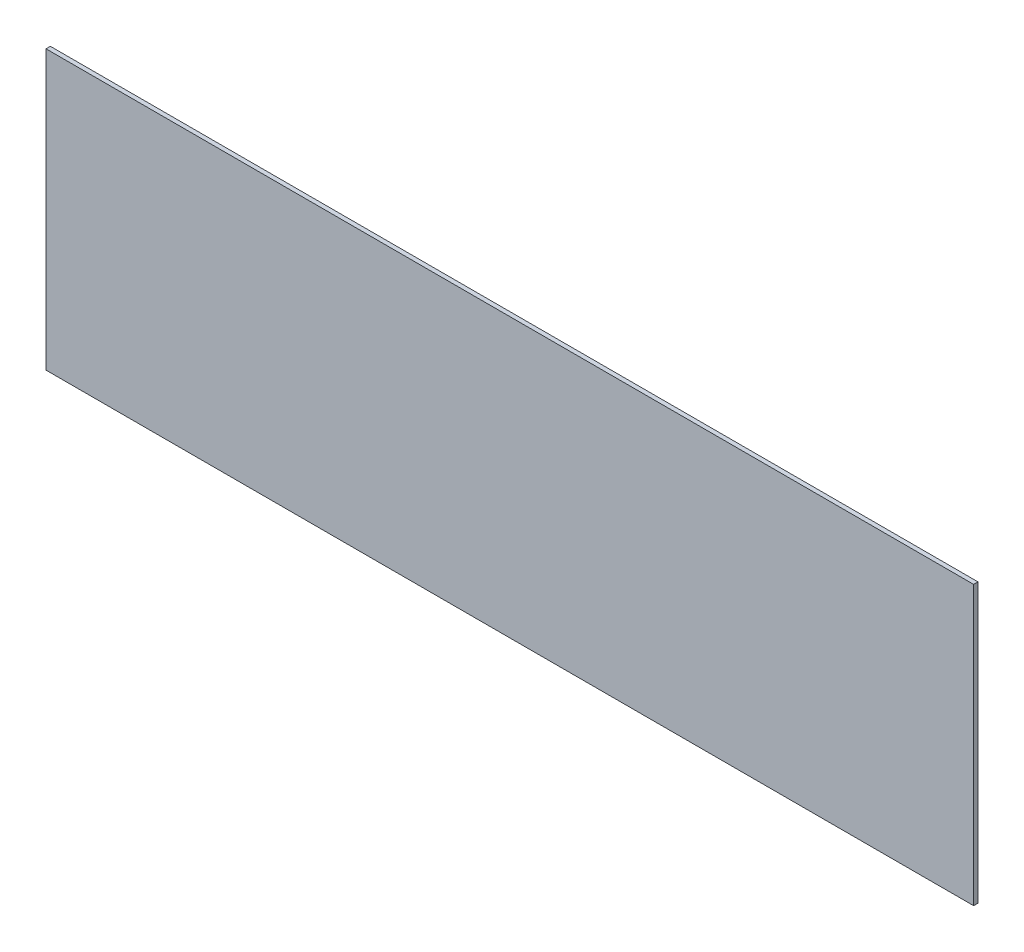
ISO-10303-21;
HEADER;
FILE_DESCRIPTION(('STEP AP214'),'2;1');
FILE_NAME('part.step','',(''),(''),'','','');
FILE_SCHEMA(('AUTOMOTIVE_DESIGN { 1 0 10303 214 1 1 1 1 }'));
ENDSEC;
DATA;
#1=APPLICATION_CONTEXT('core data for automotive mechanical design processes');
#2=APPLICATION_PROTOCOL_DEFINITION('international standard','automotive_design',2000,#1);
#3=PRODUCT_CONTEXT('',#1,'mechanical');
#4=PRODUCT('Part','Part','',(#3));
#5=PRODUCT_RELATED_PRODUCT_CATEGORY('part','',(#4));
#6=PRODUCT_DEFINITION_FORMATION('','',#4);
#7=PRODUCT_DEFINITION_CONTEXT('part definition',#1,'design');
#8=PRODUCT_DEFINITION('design','',#6,#7);
#9=PRODUCT_DEFINITION_SHAPE('','',#8);
#10=(LENGTH_UNIT() NAMED_UNIT(*) SI_UNIT(.MILLI.,.METRE.));
#11=(NAMED_UNIT(*) PLANE_ANGLE_UNIT() SI_UNIT($,.RADIAN.));
#12=(NAMED_UNIT(*) SI_UNIT($,.STERADIAN.) SOLID_ANGLE_UNIT());
#13=UNCERTAINTY_MEASURE_WITH_UNIT(LENGTH_MEASURE(1.E-05),#10,'distance_accuracy_value','');
#14=(GEOMETRIC_REPRESENTATION_CONTEXT(3) GLOBAL_UNCERTAINTY_ASSIGNED_CONTEXT((#13)) GLOBAL_UNIT_ASSIGNED_CONTEXT((#10,
#11,#12)) REPRESENTATION_CONTEXT('',''));
#15=CARTESIAN_POINT('',(0.,0.,0.));
#16=DIRECTION('',(0.,0.,1.));
#17=DIRECTION('',(1.,0.,0.));
#18=AXIS2_PLACEMENT_3D('',#15,#16,#17);
#19=CARTESIAN_POINT('',(481.0125,-130.175,4.7625));
#20=DIRECTION('',(0.,0.,1.));
#21=DIRECTION('',(1.,0.,0.));
#22=AXIS2_PLACEMENT_3D('',#19,#20,#21);
#23=PLANE('',#22);
#24=DIRECTION('',(0.,1.,0.));
#25=VECTOR('',#24,1.);
#26=CARTESIAN_POINT('',(989.0125,22.225,4.7625));
#27=LINE('',#26,#25);
#28=CARTESIAN_POINT('',(989.0125,22.225,4.7625));
#29=VERTEX_POINT('',#28);
#30=CARTESIAN_POINT('',(989.0125,-282.575,4.7625));
#31=VERTEX_POINT('',#30);
#32=EDGE_CURVE('E68',#29,#31,#27,.F.);
#33=ORIENTED_EDGE('',*,*,#32,.F.);
#34=DIRECTION('',(1.,0.,0.));
#35=VECTOR('',#34,1.);
#36=CARTESIAN_POINT('',(-26.9875,22.225,4.7625));
#37=LINE('',#36,#35);
#38=CARTESIAN_POINT('',(-26.9875,22.225,4.7625));
#39=VERTEX_POINT('',#38);
#40=EDGE_CURVE('E20',#39,#29,#37,.T.);
#41=ORIENTED_EDGE('',*,*,#40,.F.);
#42=DIRECTION('',(0.,1.,0.));
#43=VECTOR('',#42,1.);
#44=CARTESIAN_POINT('',(-26.9875,-282.575,4.7625));
#45=LINE('',#44,#43);
#46=CARTESIAN_POINT('',(-26.9875,-282.575,4.7625));
#47=VERTEX_POINT('',#46);
#48=EDGE_CURVE('E58',#47,#39,#45,.T.);
#49=ORIENTED_EDGE('',*,*,#48,.F.);
#50=DIRECTION('',(1.,0.,0.));
#51=VECTOR('',#50,1.);
#52=CARTESIAN_POINT('',(989.0125,-282.575,4.7625));
#53=LINE('',#52,#51);
#54=EDGE_CURVE('E53',#31,#47,#53,.F.);
#55=ORIENTED_EDGE('',*,*,#54,.F.);
#56=EDGE_LOOP('',(#33,#41,#49,#55));
#57=FACE_BOUND('',#56,.T.);
#58=ADVANCED_FACE('F17',(#57),#23,.T.);
#59=CARTESIAN_POINT('',(-26.9875,22.225,0.));
#60=DIRECTION('',(0.,1.,0.));
#61=DIRECTION('',(0.,0.,1.));
#62=AXIS2_PLACEMENT_3D('',#59,#60,#61);
#63=PLANE('',#62);
#64=ORIENTED_EDGE('',*,*,#40,.T.);
#65=DIRECTION('',(0.,0.,-1.));
#66=VECTOR('',#65,1.);
#67=CARTESIAN_POINT('',(989.0125,22.225,0.));
#68=LINE('',#67,#66);
#69=CARTESIAN_POINT('',(989.0125,22.225,0.));
#70=VERTEX_POINT('',#69);
#71=EDGE_CURVE('E79',#70,#29,#68,.F.);
#72=ORIENTED_EDGE('',*,*,#71,.F.);
#73=DIRECTION('',(1.,0.,0.));
#74=VECTOR('',#73,1.);
#75=CARTESIAN_POINT('',(481.0125,22.225,0.));
#76=LINE('',#75,#74);
#77=CARTESIAN_POINT('',(-26.9875,22.225,0.));
#78=VERTEX_POINT('',#77);
#79=EDGE_CURVE('E74',#70,#78,#76,.F.);
#80=ORIENTED_EDGE('',*,*,#79,.T.);
#81=DIRECTION('',(0.,0.,1.));
#82=VECTOR('',#81,1.);
#83=CARTESIAN_POINT('',(-26.9875,22.225,0.));
#84=LINE('',#83,#82);
#85=EDGE_CURVE('E63',#39,#78,#84,.F.);
#86=ORIENTED_EDGE('',*,*,#85,.F.);
#87=EDGE_LOOP('',(#64,#72,#80,#86));
#88=FACE_BOUND('',#87,.T.);
#89=ADVANCED_FACE('F73',(#88),#63,.T.);
#90=CARTESIAN_POINT('',(-26.9875,-282.575,0.));
#91=DIRECTION('',(-1.,0.,0.));
#92=DIRECTION('',(0.,0.,1.));
#93=AXIS2_PLACEMENT_3D('',#90,#91,#92);
#94=PLANE('',#93);
#95=ORIENTED_EDGE('',*,*,#48,.T.);
#96=ORIENTED_EDGE('',*,*,#85,.T.);
#97=DIRECTION('',(0.,1.,0.));
#98=VECTOR('',#97,1.);
#99=CARTESIAN_POINT('',(-26.9875,-130.175,0.));
#100=LINE('',#99,#98);
#101=CARTESIAN_POINT('',(-26.9875,-282.575,0.));
#102=VERTEX_POINT('',#101);
#103=EDGE_CURVE('E84',#78,#102,#100,.F.);
#104=ORIENTED_EDGE('',*,*,#103,.T.);
#105=DIRECTION('',(0.,0.,-1.));
#106=VECTOR('',#105,1.);
#107=CARTESIAN_POINT('',(-26.9874999999999,-282.575,0.));
#108=LINE('',#107,#106);
#109=EDGE_CURVE('E65',#47,#102,#108,.T.);
#110=ORIENTED_EDGE('',*,*,#109,.F.);
#111=EDGE_LOOP('',(#95,#96,#104,#110));
#112=FACE_BOUND('',#111,.T.);
#113=ADVANCED_FACE('F60',(#112),#94,.T.);
#114=CARTESIAN_POINT('',(989.0125,-282.575,0.));
#115=DIRECTION('',(0.,-1.,0.));
#116=DIRECTION('',(0.,0.,-1.));
#117=AXIS2_PLACEMENT_3D('',#114,#115,#116);
#118=PLANE('',#117);
#119=ORIENTED_EDGE('',*,*,#54,.T.);
#120=ORIENTED_EDGE('',*,*,#109,.T.);
#121=DIRECTION('',(1.,0.,0.));
#122=VECTOR('',#121,1.);
#123=CARTESIAN_POINT('',(481.0125,-282.575,0.));
#124=LINE('',#123,#122);
#125=CARTESIAN_POINT('',(989.0125,-282.575,0.));
#126=VERTEX_POINT('',#125);
#127=EDGE_CURVE('E26',#102,#126,#124,.T.);
#128=ORIENTED_EDGE('',*,*,#127,.T.);
#129=DIRECTION('',(0.,0.,-1.));
#130=VECTOR('',#129,1.);
#131=CARTESIAN_POINT('',(989.0125,-282.575,0.));
#132=LINE('',#131,#130);
#133=EDGE_CURVE('E34',#31,#126,#132,.T.);
#134=ORIENTED_EDGE('',*,*,#133,.F.);
#135=EDGE_LOOP('',(#119,#120,#128,#134));
#136=FACE_BOUND('',#135,.T.);
#137=ADVANCED_FACE('F88',(#136),#118,.T.);
#138=CARTESIAN_POINT('',(989.0125,22.225,0.));
#139=DIRECTION('',(1.,0.,0.));
#140=DIRECTION('',(0.,0.,-1.));
#141=AXIS2_PLACEMENT_3D('',#138,#139,#140);
#142=PLANE('',#141);
#143=ORIENTED_EDGE('',*,*,#32,.T.);
#144=ORIENTED_EDGE('',*,*,#133,.T.);
#145=DIRECTION('',(0.,1.,0.));
#146=VECTOR('',#145,1.);
#147=CARTESIAN_POINT('',(989.0125,-130.175,0.));
#148=LINE('',#147,#146);
#149=EDGE_CURVE('E11',#126,#70,#148,.T.);
#150=ORIENTED_EDGE('',*,*,#149,.T.);
#151=ORIENTED_EDGE('',*,*,#71,.T.);
#152=EDGE_LOOP('',(#143,#144,#150,#151));
#153=FACE_BOUND('',#152,.T.);
#154=ADVANCED_FACE('F91',(#153),#142,.T.);
#155=CARTESIAN_POINT('',(481.0125,-130.175,0.));
#156=DIRECTION('',(0.,0.,1.));
#157=DIRECTION('',(1.,0.,0.));
#158=AXIS2_PLACEMENT_3D('',#155,#156,#157);
#159=PLANE('',#158);
#160=ORIENTED_EDGE('',*,*,#127,.F.);
#161=ORIENTED_EDGE('',*,*,#103,.F.);
#162=ORIENTED_EDGE('',*,*,#79,.F.);
#163=ORIENTED_EDGE('',*,*,#149,.F.);
#164=EDGE_LOOP('',(#160,#161,#162,#163));
#165=FACE_BOUND('',#164,.T.);
#166=ADVANCED_FACE('F90',(#165),#159,.F.);
#167=CLOSED_SHELL('',(#58,#89,#113,#137,#154,#166));
#168=MANIFOLD_SOLID_BREP('B1',#167);
#169=ADVANCED_BREP_SHAPE_REPRESENTATION('',(#18,#168),#14);
#170=SHAPE_DEFINITION_REPRESENTATION(#9,#169);
ENDSEC;
END-ISO-10303-21;
